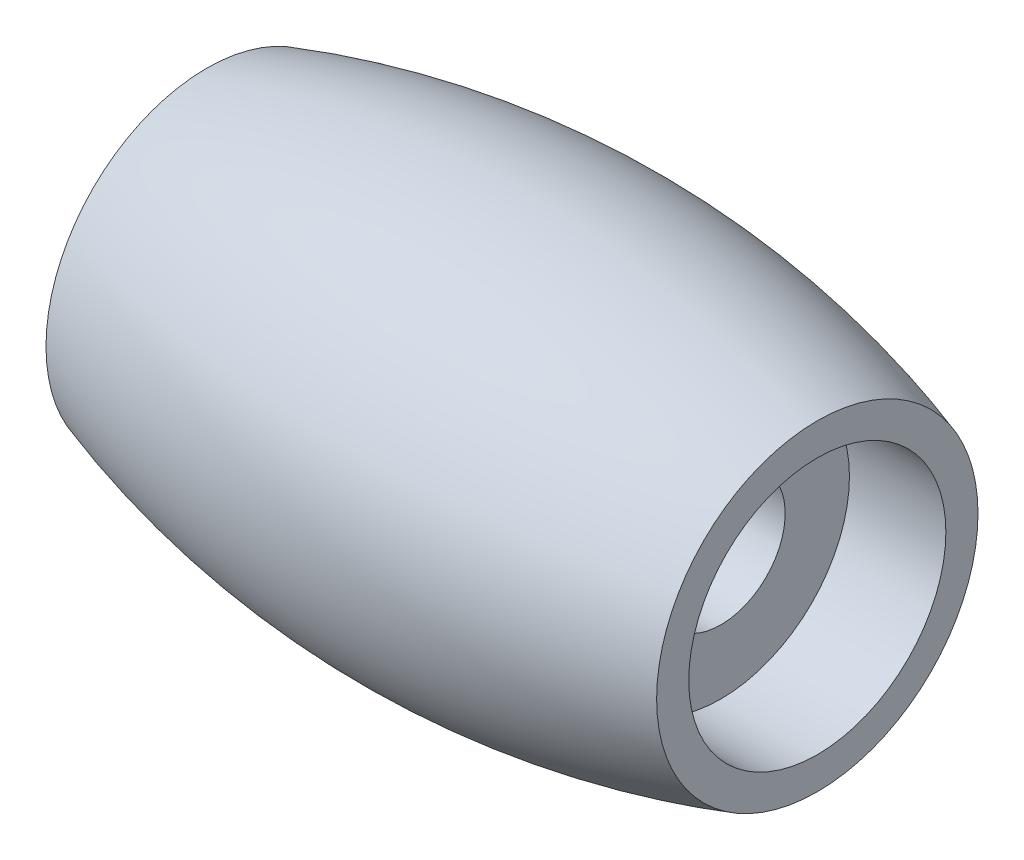
ISO-10303-21;
HEADER;
FILE_DESCRIPTION(('STEP AP214'),'2;1');
FILE_NAME('part.step','',(''),(''),'','','');
FILE_SCHEMA(('AUTOMOTIVE_DESIGN { 1 0 10303 214 1 1 1 1 }'));
ENDSEC;
DATA;
#1=APPLICATION_CONTEXT('core data for automotive mechanical design processes');
#2=APPLICATION_PROTOCOL_DEFINITION('international standard','automotive_design',2000,#1);
#3=PRODUCT_CONTEXT('',#1,'mechanical');
#4=PRODUCT('Part','Part','',(#3));
#5=PRODUCT_RELATED_PRODUCT_CATEGORY('part','',(#4));
#6=PRODUCT_DEFINITION_FORMATION('','',#4);
#7=PRODUCT_DEFINITION_CONTEXT('part definition',#1,'design');
#8=PRODUCT_DEFINITION('design','',#6,#7);
#9=PRODUCT_DEFINITION_SHAPE('','',#8);
#10=(LENGTH_UNIT() NAMED_UNIT(*) SI_UNIT(.MILLI.,.METRE.));
#11=(NAMED_UNIT(*) PLANE_ANGLE_UNIT() SI_UNIT($,.RADIAN.));
#12=(NAMED_UNIT(*) SI_UNIT($,.STERADIAN.) SOLID_ANGLE_UNIT());
#13=UNCERTAINTY_MEASURE_WITH_UNIT(LENGTH_MEASURE(1.E-05),#10,'distance_accuracy_value','');
#14=(GEOMETRIC_REPRESENTATION_CONTEXT(3) GLOBAL_UNCERTAINTY_ASSIGNED_CONTEXT((#13)) GLOBAL_UNIT_ASSIGNED_CONTEXT((#10,
#11,#12)) REPRESENTATION_CONTEXT('',''));
#15=CARTESIAN_POINT('',(0.,0.,0.));
#16=DIRECTION('',(0.,0.,1.));
#17=DIRECTION('',(1.,0.,0.));
#18=AXIS2_PLACEMENT_3D('',#15,#16,#17);
#19=CARTESIAN_POINT('',(0.,0.,0.));
#20=DIRECTION('',(-1.,0.,0.));
#21=DIRECTION('',(0.,0.,1.));
#22=AXIS2_PLACEMENT_3D('',#19,#20,#21);
#23=CYLINDRICAL_SURFACE('',#22,4.);
#24=CARTESIAN_POINT('',(3.,0.,0.));
#25=DIRECTION('',(-1.,0.,0.));
#26=DIRECTION('',(0.,0.,1.));
#27=AXIS2_PLACEMENT_3D('',#24,#25,#26);
#28=CIRCLE('',#27,4.);
#29=CARTESIAN_POINT('',(3.,0.,4.));
#30=VERTEX_POINT('',#29);
#31=EDGE_CURVE('E71',#30,#30,#28,.T.);
#32=ORIENTED_EDGE('',*,*,#31,.F.);
#33=EDGE_LOOP('',(#32));
#34=FACE_BOUND('',#33,.T.);
#35=CARTESIAN_POINT('',(0.,0.,0.));
#36=DIRECTION('',(-1.,0.,0.));
#37=DIRECTION('',(0.,0.,1.));
#38=AXIS2_PLACEMENT_3D('',#35,#36,#37);
#39=CIRCLE('',#38,4.);
#40=CARTESIAN_POINT('',(0.,0.,4.));
#41=VERTEX_POINT('',#40);
#42=EDGE_CURVE('E10',#41,#41,#39,.T.);
#43=ORIENTED_EDGE('',*,*,#42,.T.);
#44=EDGE_LOOP('',(#43));
#45=FACE_BOUND('',#44,.T.);
#46=ADVANCED_FACE('F36',(#34,#45),#23,.F.);
#47=CARTESIAN_POINT('',(0.,4.,0.));
#48=DIRECTION('',(1.,0.,0.));
#49=DIRECTION('',(0.,0.,-1.));
#50=AXIS2_PLACEMENT_3D('',#47,#48,#49);
#51=PLANE('',#50);
#52=ORIENTED_EDGE('',*,*,#42,.F.);
#53=EDGE_LOOP('',(#52));
#54=FACE_BOUND('',#53,.T.);
#55=CARTESIAN_POINT('',(0.,0.,0.));
#56=DIRECTION('',(-1.,0.,0.));
#57=DIRECTION('',(0.,0.,1.));
#58=AXIS2_PLACEMENT_3D('',#55,#56,#57);
#59=CIRCLE('',#58,5.);
#60=CARTESIAN_POINT('',(0.,0.,5.));
#61=VERTEX_POINT('',#60);
#62=EDGE_CURVE('E43',#61,#61,#59,.T.);
#63=ORIENTED_EDGE('',*,*,#62,.T.);
#64=EDGE_LOOP('',(#63));
#65=FACE_BOUND('',#64,.T.);
#66=ADVANCED_FACE('F79',(#54,#65),#51,.F.);
#67=CARTESIAN_POINT('',(9.5,0.,0.));
#68=DIRECTION('',(-1.,0.,0.));
#69=DIRECTION('',(0.,0.,1.));
#70=AXIS2_PLACEMENT_3D('',#67,#68,#69);
#71=DEGENERATE_TOROIDAL_SURFACE('',#70,24.3329829543468,30.833,.F.);
#72=ORIENTED_EDGE('',*,*,#62,.F.);
#73=EDGE_LOOP('',(#72));
#74=FACE_BOUND('',#73,.T.);
#75=CARTESIAN_POINT('',(19.,0.,0.));
#76=DIRECTION('',(-1.,0.,0.));
#77=DIRECTION('',(0.,0.,1.));
#78=AXIS2_PLACEMENT_3D('',#75,#76,#77);
#79=CIRCLE('',#78,5.);
#80=CARTESIAN_POINT('',(19.,0.,5.));
#81=VERTEX_POINT('',#80);
#82=EDGE_CURVE('E48',#81,#81,#79,.T.);
#83=ORIENTED_EDGE('',*,*,#82,.T.);
#84=EDGE_LOOP('',(#83));
#85=FACE_BOUND('',#84,.T.);
#86=ADVANCED_FACE('F83',(#74,#85),#71,.F.);
#87=CARTESIAN_POINT('',(19.,4.,0.));
#88=DIRECTION('',(-1.,0.,0.));
#89=DIRECTION('',(0.,0.,1.));
#90=AXIS2_PLACEMENT_3D('',#87,#88,#89);
#91=PLANE('',#90);
#92=ORIENTED_EDGE('',*,*,#82,.F.);
#93=EDGE_LOOP('',(#92));
#94=FACE_BOUND('',#93,.T.);
#95=CARTESIAN_POINT('',(19.,0.,0.));
#96=DIRECTION('',(-1.,0.,0.));
#97=DIRECTION('',(0.,0.,1.));
#98=AXIS2_PLACEMENT_3D('',#95,#96,#97);
#99=CIRCLE('',#98,4.);
#100=CARTESIAN_POINT('',(19.,0.,4.));
#101=VERTEX_POINT('',#100);
#102=EDGE_CURVE('E53',#101,#101,#99,.T.);
#103=ORIENTED_EDGE('',*,*,#102,.T.);
#104=EDGE_LOOP('',(#103));
#105=FACE_BOUND('',#104,.T.);
#106=ADVANCED_FACE('F88',(#94,#105),#91,.F.);
#107=CARTESIAN_POINT('',(0.,0.,0.));
#108=DIRECTION('',(-1.,0.,0.));
#109=DIRECTION('',(0.,0.,1.));
#110=AXIS2_PLACEMENT_3D('',#107,#108,#109);
#111=CYLINDRICAL_SURFACE('',#110,4.);
#112=ORIENTED_EDGE('',*,*,#102,.F.);
#113=EDGE_LOOP('',(#112));
#114=FACE_BOUND('',#113,.T.);
#115=CARTESIAN_POINT('',(16.,0.,0.));
#116=DIRECTION('',(-1.,0.,0.));
#117=DIRECTION('',(0.,0.,1.));
#118=AXIS2_PLACEMENT_3D('',#115,#116,#117);
#119=CIRCLE('',#118,4.);
#120=CARTESIAN_POINT('',(16.,0.,4.));
#121=VERTEX_POINT('',#120);
#122=EDGE_CURVE('E59',#121,#121,#119,.T.);
#123=ORIENTED_EDGE('',*,*,#122,.T.);
#124=EDGE_LOOP('',(#123));
#125=FACE_BOUND('',#124,.T.);
#126=ADVANCED_FACE('F94',(#114,#125),#111,.F.);
#127=CARTESIAN_POINT('',(16.,2.,0.));
#128=DIRECTION('',(-1.,0.,0.));
#129=DIRECTION('',(0.,0.,1.));
#130=AXIS2_PLACEMENT_3D('',#127,#128,#129);
#131=PLANE('',#130);
#132=ORIENTED_EDGE('',*,*,#122,.F.);
#133=EDGE_LOOP('',(#132));
#134=FACE_BOUND('',#133,.T.);
#135=CARTESIAN_POINT('',(16.,0.,0.));
#136=DIRECTION('',(-1.,0.,0.));
#137=DIRECTION('',(0.,0.,1.));
#138=AXIS2_PLACEMENT_3D('',#135,#136,#137);
#139=CIRCLE('',#138,2.);
#140=CARTESIAN_POINT('',(16.,0.,2.));
#141=VERTEX_POINT('',#140);
#142=EDGE_CURVE('E63',#141,#141,#139,.T.);
#143=ORIENTED_EDGE('',*,*,#142,.T.);
#144=EDGE_LOOP('',(#143));
#145=FACE_BOUND('',#144,.T.);
#146=ADVANCED_FACE('F98',(#134,#145),#131,.F.);
#147=CARTESIAN_POINT('',(0.,0.,0.));
#148=DIRECTION('',(-1.,0.,0.));
#149=DIRECTION('',(0.,0.,1.));
#150=AXIS2_PLACEMENT_3D('',#147,#148,#149);
#151=CYLINDRICAL_SURFACE('',#150,2.);
#152=ORIENTED_EDGE('',*,*,#142,.F.);
#153=EDGE_LOOP('',(#152));
#154=FACE_BOUND('',#153,.T.);
#155=CARTESIAN_POINT('',(3.,0.,0.));
#156=DIRECTION('',(-1.,0.,0.));
#157=DIRECTION('',(0.,0.,1.));
#158=AXIS2_PLACEMENT_3D('',#155,#156,#157);
#159=CIRCLE('',#158,2.);
#160=CARTESIAN_POINT('',(3.,0.,2.));
#161=VERTEX_POINT('',#160);
#162=EDGE_CURVE('E67',#161,#161,#159,.T.);
#163=ORIENTED_EDGE('',*,*,#162,.T.);
#164=EDGE_LOOP('',(#163));
#165=FACE_BOUND('',#164,.T.);
#166=ADVANCED_FACE('F102',(#154,#165),#151,.F.);
#167=CARTESIAN_POINT('',(3.,4.,0.));
#168=DIRECTION('',(1.,0.,0.));
#169=DIRECTION('',(0.,0.,-1.));
#170=AXIS2_PLACEMENT_3D('',#167,#168,#169);
#171=PLANE('',#170);
#172=ORIENTED_EDGE('',*,*,#162,.F.);
#173=EDGE_LOOP('',(#172));
#174=FACE_BOUND('',#173,.T.);
#175=ORIENTED_EDGE('',*,*,#31,.T.);
#176=EDGE_LOOP('',(#175));
#177=FACE_BOUND('',#176,.T.);
#178=ADVANCED_FACE('F76',(#174,#177),#171,.F.);
#179=CLOSED_SHELL('',(#46,#66,#86,#106,#126,#146,#166,#178));
#180=MANIFOLD_SOLID_BREP('B2',#179);
#181=ADVANCED_BREP_SHAPE_REPRESENTATION('',(#18,#180),#14);
#182=SHAPE_DEFINITION_REPRESENTATION(#9,#181);
ENDSEC;
END-ISO-10303-21;
